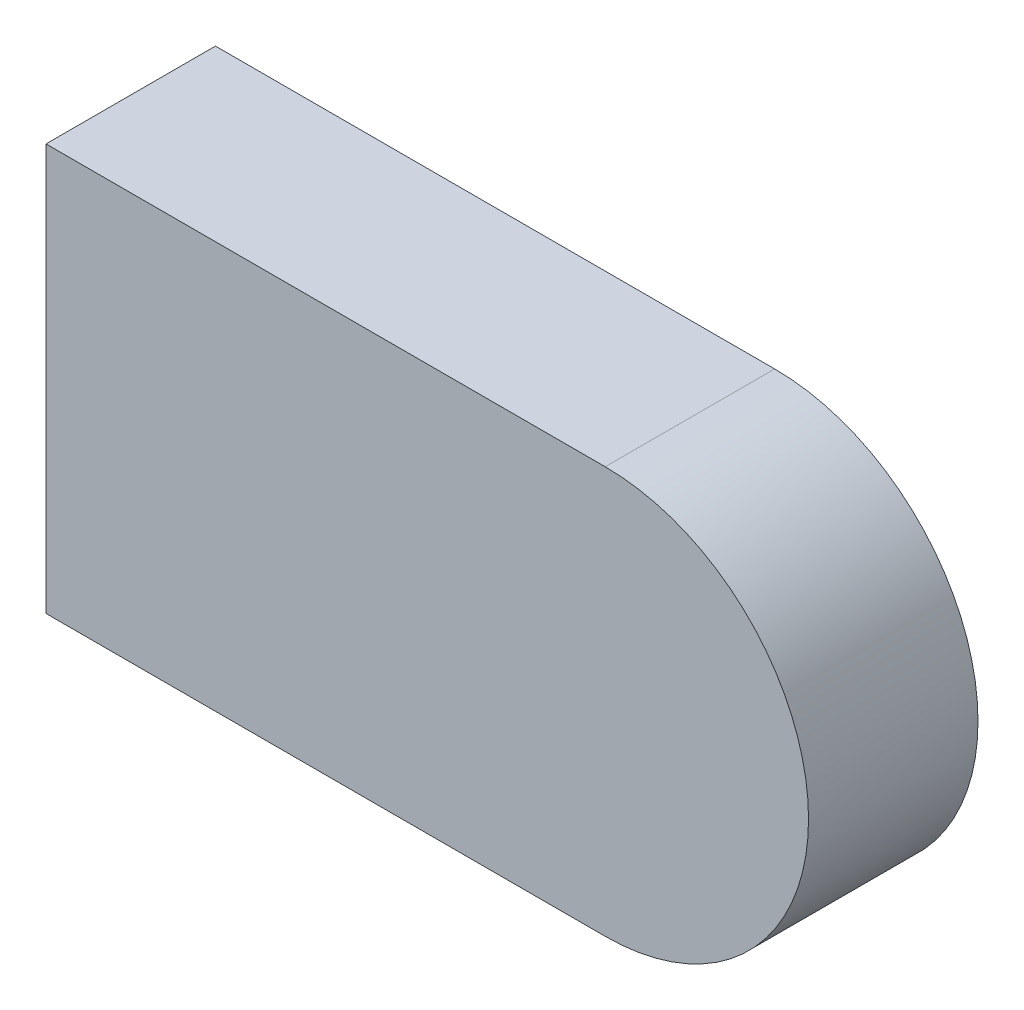
ISO-10303-21;
HEADER;
FILE_DESCRIPTION(('STEP AP214'),'2;1');
FILE_NAME('part.step','',(''),(''),'','','');
FILE_SCHEMA(('AUTOMOTIVE_DESIGN { 1 0 10303 214 1 1 1 1 }'));
ENDSEC;
DATA;
#1=APPLICATION_CONTEXT('core data for automotive mechanical design processes');
#2=APPLICATION_PROTOCOL_DEFINITION('international standard','automotive_design',2000,#1);
#3=PRODUCT_CONTEXT('',#1,'mechanical');
#4=PRODUCT('Part','Part','',(#3));
#5=PRODUCT_RELATED_PRODUCT_CATEGORY('part','',(#4));
#6=PRODUCT_DEFINITION_FORMATION('','',#4);
#7=PRODUCT_DEFINITION_CONTEXT('part definition',#1,'design');
#8=PRODUCT_DEFINITION('design','',#6,#7);
#9=PRODUCT_DEFINITION_SHAPE('','',#8);
#10=(LENGTH_UNIT() NAMED_UNIT(*) SI_UNIT(.MILLI.,.METRE.));
#11=(NAMED_UNIT(*) PLANE_ANGLE_UNIT() SI_UNIT($,.RADIAN.));
#12=(NAMED_UNIT(*) SI_UNIT($,.STERADIAN.) SOLID_ANGLE_UNIT());
#13=UNCERTAINTY_MEASURE_WITH_UNIT(LENGTH_MEASURE(1.E-05),#10,'distance_accuracy_value','');
#14=(GEOMETRIC_REPRESENTATION_CONTEXT(3) GLOBAL_UNCERTAINTY_ASSIGNED_CONTEXT((#13)) GLOBAL_UNIT_ASSIGNED_CONTEXT((#10,
#11,#12)) REPRESENTATION_CONTEXT('',''));
#15=CARTESIAN_POINT('',(0.,0.,0.));
#16=DIRECTION('',(0.,0.,1.));
#17=DIRECTION('',(1.,0.,0.));
#18=AXIS2_PLACEMENT_3D('',#15,#16,#17);
#19=CARTESIAN_POINT('',(-4.05,-2.37,0.));
#20=DIRECTION('',(0.,1.,0.));
#21=DIRECTION('',(1.,0.,0.));
#22=AXIS2_PLACEMENT_3D('',#19,#20,#21);
#23=PLANE('',#22);
#24=DIRECTION('',(1.,0.,0.));
#25=VECTOR('',#24,1.);
#26=CARTESIAN_POINT('',(-4.05,-2.37,0.));
#27=LINE('',#26,#25);
#28=CARTESIAN_POINT('',(-4.05,-2.37,0.));
#29=VERTEX_POINT('',#28);
#30=CARTESIAN_POINT('',(-3.72,-2.37,0.));
#31=VERTEX_POINT('',#30);
#32=EDGE_CURVE('E11',#29,#31,#27,.T.);
#33=ORIENTED_EDGE('',*,*,#32,.T.);
#34=DIRECTION('',(0.,0.,1.));
#35=VECTOR('',#34,1.);
#36=CARTESIAN_POINT('',(-3.72,-2.37,0.));
#37=LINE('',#36,#35);
#38=CARTESIAN_POINT('',(-3.72,-2.37,0.1));
#39=VERTEX_POINT('',#38);
#40=EDGE_CURVE('E24',#31,#39,#37,.T.);
#41=ORIENTED_EDGE('',*,*,#40,.T.);
#42=DIRECTION('',(1.,0.,0.));
#43=VECTOR('',#42,1.);
#44=CARTESIAN_POINT('',(-4.05,-2.37,0.1));
#45=LINE('',#44,#43);
#46=CARTESIAN_POINT('',(-4.05,-2.37,0.1));
#47=VERTEX_POINT('',#46);
#48=EDGE_CURVE('E88',#47,#39,#45,.T.);
#49=ORIENTED_EDGE('',*,*,#48,.F.);
#50=DIRECTION('',(0.,0.,1.));
#51=VECTOR('',#50,1.);
#52=CARTESIAN_POINT('',(-4.05,-2.37,0.));
#53=LINE('',#52,#51);
#54=EDGE_CURVE('E36',#29,#47,#53,.T.);
#55=ORIENTED_EDGE('',*,*,#54,.F.);
#56=EDGE_LOOP('',(#33,#41,#49,#55));
#57=FACE_BOUND('',#56,.T.);
#58=ADVANCED_FACE('F17',(#57),#23,.F.);
#59=CARTESIAN_POINT('',(-3.72,-2.25,0.));
#60=DIRECTION('',(0.,0.,-1.));
#61=DIRECTION('',(1.,0.,0.));
#62=AXIS2_PLACEMENT_3D('',#59,#60,#61);
#63=CYLINDRICAL_SURFACE('',#62,0.12);
#64=CARTESIAN_POINT('',(-3.72,-2.25,0.));
#65=DIRECTION('',(0.,0.,1.));
#66=DIRECTION('',(1.,0.,0.));
#67=AXIS2_PLACEMENT_3D('',#64,#65,#66);
#68=CIRCLE('',#67,0.12);
#69=CARTESIAN_POINT('',(-3.72,-2.13,0.));
#70=VERTEX_POINT('',#69);
#71=EDGE_CURVE('E85',#31,#70,#68,.T.);
#72=ORIENTED_EDGE('',*,*,#71,.T.);
#73=DIRECTION('',(0.,0.,1.));
#74=VECTOR('',#73,1.);
#75=CARTESIAN_POINT('',(-3.72,-2.13,0.));
#76=LINE('',#75,#74);
#77=CARTESIAN_POINT('',(-3.72,-2.13,0.1));
#78=VERTEX_POINT('',#77);
#79=EDGE_CURVE('E73',#70,#78,#76,.T.);
#80=ORIENTED_EDGE('',*,*,#79,.T.);
#81=CARTESIAN_POINT('',(-3.72,-2.25,0.1));
#82=DIRECTION('',(0.,0.,1.));
#83=DIRECTION('',(1.,0.,0.));
#84=AXIS2_PLACEMENT_3D('',#81,#82,#83);
#85=CIRCLE('',#84,0.12);
#86=EDGE_CURVE('E66',#39,#78,#85,.T.);
#87=ORIENTED_EDGE('',*,*,#86,.F.);
#88=ORIENTED_EDGE('',*,*,#40,.F.);
#89=EDGE_LOOP('',(#72,#80,#87,#88));
#90=FACE_BOUND('',#89,.T.);
#91=ADVANCED_FACE('F89',(#90),#63,.T.);
#92=CARTESIAN_POINT('',(-4.05,-2.13,0.));
#93=DIRECTION('',(0.,1.,0.));
#94=DIRECTION('',(1.,0.,0.));
#95=AXIS2_PLACEMENT_3D('',#92,#93,#94);
#96=PLANE('',#95);
#97=DIRECTION('',(0.,0.,1.));
#98=VECTOR('',#97,1.);
#99=CARTESIAN_POINT('',(-4.05,-2.13,0.));
#100=LINE('',#99,#98);
#101=CARTESIAN_POINT('',(-4.05,-2.13,0.));
#102=VERTEX_POINT('',#101);
#103=CARTESIAN_POINT('',(-4.05,-2.13,0.1));
#104=VERTEX_POINT('',#103);
#105=EDGE_CURVE('E56',#102,#104,#100,.T.);
#106=ORIENTED_EDGE('',*,*,#105,.T.);
#107=DIRECTION('',(1.,0.,0.));
#108=VECTOR('',#107,1.);
#109=CARTESIAN_POINT('',(-4.05,-2.13,0.1));
#110=LINE('',#109,#108);
#111=EDGE_CURVE('E67',#104,#78,#110,.T.);
#112=ORIENTED_EDGE('',*,*,#111,.T.);
#113=ORIENTED_EDGE('',*,*,#79,.F.);
#114=DIRECTION('',(1.,0.,0.));
#115=VECTOR('',#114,1.);
#116=CARTESIAN_POINT('',(-4.05,-2.13,0.));
#117=LINE('',#116,#115);
#118=EDGE_CURVE('E71',#102,#70,#117,.T.);
#119=ORIENTED_EDGE('',*,*,#118,.F.);
#120=EDGE_LOOP('',(#106,#112,#113,#119));
#121=FACE_BOUND('',#120,.T.);
#122=ADVANCED_FACE('F72',(#121),#96,.T.);
#123=CARTESIAN_POINT('',(-4.05,-2.37,0.));
#124=DIRECTION('',(-1.,0.,0.));
#125=DIRECTION('',(0.,1.,0.));
#126=AXIS2_PLACEMENT_3D('',#123,#124,#125);
#127=PLANE('',#126);
#128=ORIENTED_EDGE('',*,*,#54,.T.);
#129=DIRECTION('',(0.,1.,0.));
#130=VECTOR('',#129,1.);
#131=CARTESIAN_POINT('',(-4.05,-2.37,0.1));
#132=LINE('',#131,#130);
#133=EDGE_CURVE('E62',#47,#104,#132,.T.);
#134=ORIENTED_EDGE('',*,*,#133,.T.);
#135=ORIENTED_EDGE('',*,*,#105,.F.);
#136=DIRECTION('',(0.,1.,0.));
#137=VECTOR('',#136,1.);
#138=CARTESIAN_POINT('',(-4.05,-2.37,0.));
#139=LINE('',#138,#137);
#140=EDGE_CURVE('E60',#29,#102,#139,.T.);
#141=ORIENTED_EDGE('',*,*,#140,.F.);
#142=EDGE_LOOP('',(#128,#134,#135,#141));
#143=FACE_BOUND('',#142,.T.);
#144=ADVANCED_FACE('F58',(#143),#127,.T.);
#145=CARTESIAN_POINT('',(-3.849490847913,-2.25,0.));
#146=DIRECTION('',(0.,0.,1.));
#147=DIRECTION('',(1.,0.,0.));
#148=AXIS2_PLACEMENT_3D('',#145,#146,#147);
#149=PLANE('',#148);
#150=ORIENTED_EDGE('',*,*,#140,.T.);
#151=ORIENTED_EDGE('',*,*,#118,.T.);
#152=ORIENTED_EDGE('',*,*,#71,.F.);
#153=ORIENTED_EDGE('',*,*,#32,.F.);
#154=EDGE_LOOP('',(#150,#151,#152,#153));
#155=FACE_BOUND('',#154,.T.);
#156=ADVANCED_FACE('F77',(#155),#149,.F.);
#157=CARTESIAN_POINT('',(-3.849490847913,-2.25,0.1));
#158=DIRECTION('',(0.,0.,1.));
#159=DIRECTION('',(1.,0.,0.));
#160=AXIS2_PLACEMENT_3D('',#157,#158,#159);
#161=PLANE('',#160);
#162=ORIENTED_EDGE('',*,*,#48,.T.);
#163=ORIENTED_EDGE('',*,*,#86,.T.);
#164=ORIENTED_EDGE('',*,*,#111,.F.);
#165=ORIENTED_EDGE('',*,*,#133,.F.);
#166=EDGE_LOOP('',(#162,#163,#164,#165));
#167=FACE_BOUND('',#166,.T.);
#168=ADVANCED_FACE('F91',(#167),#161,.T.);
#169=CLOSED_SHELL('',(#58,#91,#122,#144,#156,#168));
#170=MANIFOLD_SOLID_BREP('B1',#169);
#171=ADVANCED_BREP_SHAPE_REPRESENTATION('',(#18,#170),#14);
#172=SHAPE_DEFINITION_REPRESENTATION(#9,#171);
ENDSEC;
END-ISO-10303-21;
